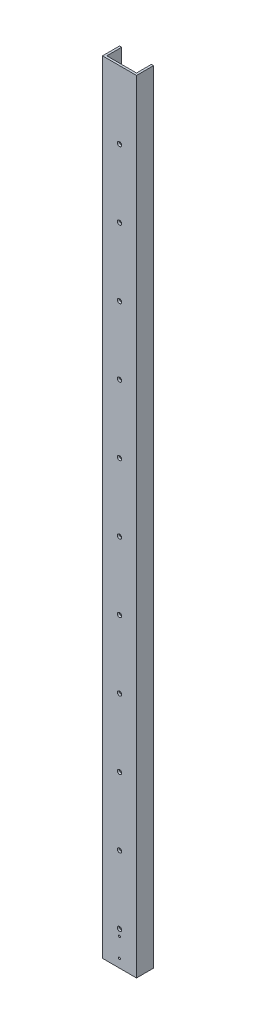
ISO-10303-21;
HEADER;
FILE_DESCRIPTION(('STEP AP214'),'2;1');
FILE_NAME('part.step','',(''),(''),'','','');
FILE_SCHEMA(('AUTOMOTIVE_DESIGN { 1 0 10303 214 1 1 1 1 }'));
ENDSEC;
DATA;
#1=APPLICATION_CONTEXT('core data for automotive mechanical design processes');
#2=APPLICATION_PROTOCOL_DEFINITION('international standard','automotive_design',2000,#1);
#3=PRODUCT_CONTEXT('',#1,'mechanical');
#4=PRODUCT('Part','Part','',(#3));
#5=PRODUCT_RELATED_PRODUCT_CATEGORY('part','',(#4));
#6=PRODUCT_DEFINITION_FORMATION('','',#4);
#7=PRODUCT_DEFINITION_CONTEXT('part definition',#1,'design');
#8=PRODUCT_DEFINITION('design','',#6,#7);
#9=PRODUCT_DEFINITION_SHAPE('','',#8);
#10=(LENGTH_UNIT() NAMED_UNIT(*) SI_UNIT(.MILLI.,.METRE.));
#11=(NAMED_UNIT(*) PLANE_ANGLE_UNIT() SI_UNIT($,.RADIAN.));
#12=(NAMED_UNIT(*) SI_UNIT($,.STERADIAN.) SOLID_ANGLE_UNIT());
#13=UNCERTAINTY_MEASURE_WITH_UNIT(LENGTH_MEASURE(1.E-05),#10,'distance_accuracy_value','');
#14=(GEOMETRIC_REPRESENTATION_CONTEXT(3) GLOBAL_UNCERTAINTY_ASSIGNED_CONTEXT((#13)) GLOBAL_UNIT_ASSIGNED_CONTEXT((#10,
#11,#12)) REPRESENTATION_CONTEXT('',''));
#15=CARTESIAN_POINT('',(0.,0.,0.));
#16=DIRECTION('',(0.,0.,1.));
#17=DIRECTION('',(1.,0.,0.));
#18=AXIS2_PLACEMENT_3D('',#15,#16,#17);
#19=CARTESIAN_POINT('',(0.,1168.4,0.));
#20=DIRECTION('',(1.,0.,0.));
#21=DIRECTION('',(0.,0.,-1.));
#22=AXIS2_PLACEMENT_3D('',#19,#20,#21);
#23=PLANE('',#22);
#24=DIRECTION('',(0.,0.,1.));
#25=VECTOR('',#24,1.);
#26=CARTESIAN_POINT('',(0.,0.,0.));
#27=LINE('',#26,#25);
#28=CARTESIAN_POINT('',(0.,0.,-25.4));
#29=VERTEX_POINT('',#28);
#30=CARTESIAN_POINT('',(0.,0.,0.));
#31=VERTEX_POINT('',#30);
#32=EDGE_CURVE('E134',#29,#31,#27,.T.);
#33=ORIENTED_EDGE('',*,*,#32,.T.);
#34=DIRECTION('',(0.,-1.,0.));
#35=VECTOR('',#34,1.);
#36=CARTESIAN_POINT('',(0.,1168.4,0.));
#37=LINE('',#36,#35);
#38=CARTESIAN_POINT('',(0.,1168.4,0.));
#39=VERTEX_POINT('',#38);
#40=EDGE_CURVE('E11',#39,#31,#37,.T.);
#41=ORIENTED_EDGE('',*,*,#40,.F.);
#42=DIRECTION('',(0.,0.,1.));
#43=VECTOR('',#42,1.);
#44=CARTESIAN_POINT('',(0.,1168.4,0.));
#45=LINE('',#44,#43);
#46=CARTESIAN_POINT('',(0.,1168.4,-25.4));
#47=VERTEX_POINT('',#46);
#48=EDGE_CURVE('E149',#47,#39,#45,.T.);
#49=ORIENTED_EDGE('',*,*,#48,.F.);
#50=DIRECTION('',(0.,-1.,0.));
#51=VECTOR('',#50,1.);
#52=CARTESIAN_POINT('',(0.,1168.4,-25.4));
#53=LINE('',#52,#51);
#54=EDGE_CURVE('E130',#47,#29,#53,.T.);
#55=ORIENTED_EDGE('',*,*,#54,.T.);
#56=EDGE_LOOP('',(#33,#41,#49,#55));
#57=FACE_BOUND('',#56,.T.);
#58=ADVANCED_FACE('F38',(#57),#23,.F.);
#59=CARTESIAN_POINT('',(0.,1168.4,0.));
#60=DIRECTION('',(0.,0.,-1.));
#61=DIRECTION('',(-1.,0.,0.));
#62=AXIS2_PLACEMENT_3D('',#59,#60,#61);
#63=PLANE('',#62);
#64=CARTESIAN_POINT('',(25.4,41.2749999999968,0.));
#65=DIRECTION('',(0.,0.,1.));
#66=DIRECTION('',(1.,0.,0.));
#67=AXIS2_PLACEMENT_3D('',#64,#65,#66);
#68=CIRCLE('',#67,1.5875);
#69=CARTESIAN_POINT('',(26.9875,41.2749999999968,0.));
#70=VERTEX_POINT('',#69);
#71=EDGE_CURVE('E251',#70,#70,#68,.T.);
#72=ORIENTED_EDGE('',*,*,#71,.F.);
#73=EDGE_LOOP('',(#72));
#74=FACE_BOUND('',#73,.T.);
#75=CARTESIAN_POINT('',(25.4,12.6999999999968,0.));
#76=DIRECTION('',(0.,0.,1.));
#77=DIRECTION('',(1.,0.,0.));
#78=AXIS2_PLACEMENT_3D('',#75,#76,#77);
#79=CIRCLE('',#78,1.5875);
#80=CARTESIAN_POINT('',(26.9875,12.6999999999968,0.));
#81=VERTEX_POINT('',#80);
#82=EDGE_CURVE('E252',#81,#81,#79,.T.);
#83=ORIENTED_EDGE('',*,*,#82,.F.);
#84=EDGE_LOOP('',(#83));
#85=FACE_BOUND('',#84,.T.);
#86=CARTESIAN_POINT('',(25.4,50.8,0.));
#87=DIRECTION('',(0.,0.,1.));
#88=DIRECTION('',(1.,0.,0.));
#89=AXIS2_PLACEMENT_3D('',#86,#87,#88);
#90=CIRCLE('',#89,3.175);
#91=CARTESIAN_POINT('',(28.575,50.8,0.));
#92=VERTEX_POINT('',#91);
#93=EDGE_CURVE('E241',#92,#92,#90,.T.);
#94=ORIENTED_EDGE('',*,*,#93,.F.);
#95=EDGE_LOOP('',(#94));
#96=FACE_BOUND('',#95,.T.);
#97=CARTESIAN_POINT('',(25.4,152.4,0.));
#98=DIRECTION('',(0.,0.,1.));
#99=DIRECTION('',(1.,0.,0.));
#100=AXIS2_PLACEMENT_3D('',#97,#98,#99);
#101=CIRCLE('',#100,3.175);
#102=CARTESIAN_POINT('',(28.575,152.4,0.));
#103=VERTEX_POINT('',#102);
#104=EDGE_CURVE('E235',#103,#103,#101,.T.);
#105=ORIENTED_EDGE('',*,*,#104,.F.);
#106=EDGE_LOOP('',(#105));
#107=FACE_BOUND('',#106,.T.);
#108=CARTESIAN_POINT('',(25.4,254.,0.));
#109=DIRECTION('',(0.,0.,1.));
#110=DIRECTION('',(1.,0.,0.));
#111=AXIS2_PLACEMENT_3D('',#108,#109,#110);
#112=CIRCLE('',#111,3.175);
#113=CARTESIAN_POINT('',(28.575,254.,0.));
#114=VERTEX_POINT('',#113);
#115=EDGE_CURVE('E229',#114,#114,#112,.T.);
#116=ORIENTED_EDGE('',*,*,#115,.F.);
#117=EDGE_LOOP('',(#116));
#118=FACE_BOUND('',#117,.T.);
#119=CARTESIAN_POINT('',(25.4,355.6,0.));
#120=DIRECTION('',(0.,0.,1.));
#121=DIRECTION('',(1.,0.,0.));
#122=AXIS2_PLACEMENT_3D('',#119,#120,#121);
#123=CIRCLE('',#122,3.17499999999997);
#124=CARTESIAN_POINT('',(28.575,355.6,0.));
#125=VERTEX_POINT('',#124);
#126=EDGE_CURVE('E223',#125,#125,#123,.T.);
#127=ORIENTED_EDGE('',*,*,#126,.F.);
#128=EDGE_LOOP('',(#127));
#129=FACE_BOUND('',#128,.T.);
#130=CARTESIAN_POINT('',(25.4,457.2,0.));
#131=DIRECTION('',(0.,0.,1.));
#132=DIRECTION('',(1.,0.,0.));
#133=AXIS2_PLACEMENT_3D('',#130,#131,#132);
#134=CIRCLE('',#133,3.17500000000002);
#135=CARTESIAN_POINT('',(28.575,457.2,0.));
#136=VERTEX_POINT('',#135);
#137=EDGE_CURVE('E217',#136,#136,#134,.T.);
#138=ORIENTED_EDGE('',*,*,#137,.F.);
#139=EDGE_LOOP('',(#138));
#140=FACE_BOUND('',#139,.T.);
#141=CARTESIAN_POINT('',(25.4,558.8,0.));
#142=DIRECTION('',(0.,0.,1.));
#143=DIRECTION('',(1.,0.,0.));
#144=AXIS2_PLACEMENT_3D('',#141,#142,#143);
#145=CIRCLE('',#144,3.175);
#146=CARTESIAN_POINT('',(28.575,558.8,0.));
#147=VERTEX_POINT('',#146);
#148=EDGE_CURVE('E211',#147,#147,#145,.T.);
#149=ORIENTED_EDGE('',*,*,#148,.F.);
#150=EDGE_LOOP('',(#149));
#151=FACE_BOUND('',#150,.T.);
#152=CARTESIAN_POINT('',(25.4,660.4,0.));
#153=DIRECTION('',(0.,0.,1.));
#154=DIRECTION('',(1.,0.,0.));
#155=AXIS2_PLACEMENT_3D('',#152,#153,#154);
#156=CIRCLE('',#155,3.175);
#157=CARTESIAN_POINT('',(28.575,660.4,0.));
#158=VERTEX_POINT('',#157);
#159=EDGE_CURVE('E205',#158,#158,#156,.T.);
#160=ORIENTED_EDGE('',*,*,#159,.F.);
#161=EDGE_LOOP('',(#160));
#162=FACE_BOUND('',#161,.T.);
#163=CARTESIAN_POINT('',(25.4,762.,0.));
#164=DIRECTION('',(0.,0.,1.));
#165=DIRECTION('',(1.,0.,0.));
#166=AXIS2_PLACEMENT_3D('',#163,#164,#165);
#167=CIRCLE('',#166,3.175);
#168=CARTESIAN_POINT('',(28.575,762.,0.));
#169=VERTEX_POINT('',#168);
#170=EDGE_CURVE('E199',#169,#169,#167,.T.);
#171=ORIENTED_EDGE('',*,*,#170,.F.);
#172=EDGE_LOOP('',(#171));
#173=FACE_BOUND('',#172,.T.);
#174=CARTESIAN_POINT('',(25.4,863.6,0.));
#175=DIRECTION('',(0.,0.,1.));
#176=DIRECTION('',(1.,0.,0.));
#177=AXIS2_PLACEMENT_3D('',#174,#175,#176);
#178=CIRCLE('',#177,3.175);
#179=CARTESIAN_POINT('',(28.575,863.6,0.));
#180=VERTEX_POINT('',#179);
#181=EDGE_CURVE('E193',#180,#180,#178,.T.);
#182=ORIENTED_EDGE('',*,*,#181,.F.);
#183=EDGE_LOOP('',(#182));
#184=FACE_BOUND('',#183,.T.);
#185=CARTESIAN_POINT('',(25.4,965.2,0.));
#186=DIRECTION('',(0.,0.,1.));
#187=DIRECTION('',(1.,0.,0.));
#188=AXIS2_PLACEMENT_3D('',#185,#186,#187);
#189=CIRCLE('',#188,3.175);
#190=CARTESIAN_POINT('',(28.575,965.2,0.));
#191=VERTEX_POINT('',#190);
#192=EDGE_CURVE('E185',#191,#191,#189,.T.);
#193=ORIENTED_EDGE('',*,*,#192,.F.);
#194=EDGE_LOOP('',(#193));
#195=FACE_BOUND('',#194,.T.);
#196=CARTESIAN_POINT('',(25.4,1066.8,0.));
#197=DIRECTION('',(0.,0.,1.));
#198=DIRECTION('',(1.,0.,0.));
#199=AXIS2_PLACEMENT_3D('',#196,#197,#198);
#200=CIRCLE('',#199,3.17499999999994);
#201=CARTESIAN_POINT('',(28.5749999999999,1066.8,0.));
#202=VERTEX_POINT('',#201);
#203=EDGE_CURVE('E186',#202,#202,#200,.T.);
#204=ORIENTED_EDGE('',*,*,#203,.F.);
#205=EDGE_LOOP('',(#204));
#206=FACE_BOUND('',#205,.T.);
#207=DIRECTION('',(1.,0.,0.));
#208=VECTOR('',#207,1.);
#209=CARTESIAN_POINT('',(0.,0.,0.));
#210=LINE('',#209,#208);
#211=CARTESIAN_POINT('',(50.8,0.,0.));
#212=VERTEX_POINT('',#211);
#213=EDGE_CURVE('E137',#31,#212,#210,.T.);
#214=ORIENTED_EDGE('',*,*,#213,.T.);
#215=DIRECTION('',(0.,-1.,0.));
#216=VECTOR('',#215,1.);
#217=CARTESIAN_POINT('',(50.8,1168.4,0.));
#218=LINE('',#217,#216);
#219=CARTESIAN_POINT('',(50.8,1168.4,0.));
#220=VERTEX_POINT('',#219);
#221=EDGE_CURVE('E46',#220,#212,#218,.T.);
#222=ORIENTED_EDGE('',*,*,#221,.F.);
#223=DIRECTION('',(1.,0.,0.));
#224=VECTOR('',#223,1.);
#225=CARTESIAN_POINT('',(0.,1168.4,0.));
#226=LINE('',#225,#224);
#227=EDGE_CURVE('E97',#39,#220,#226,.T.);
#228=ORIENTED_EDGE('',*,*,#227,.F.);
#229=ORIENTED_EDGE('',*,*,#40,.T.);
#230=EDGE_LOOP('',(#214,#222,#228,#229));
#231=FACE_BOUND('',#230,.T.);
#232=ADVANCED_FACE('F263',(#74,#85,#96,#107,#118,#129,#140,#151,#162,#173,#184,#195,#206,#231),
#63,.F.);
#233=CARTESIAN_POINT('',(50.8,1168.4,0.));
#234=DIRECTION('',(-1.,0.,0.));
#235=DIRECTION('',(0.,0.,1.));
#236=AXIS2_PLACEMENT_3D('',#233,#234,#235);
#237=PLANE('',#236);
#238=DIRECTION('',(0.,0.,-1.));
#239=VECTOR('',#238,1.);
#240=CARTESIAN_POINT('',(50.8,0.,0.));
#241=LINE('',#240,#239);
#242=CARTESIAN_POINT('',(50.8,0.,-25.4));
#243=VERTEX_POINT('',#242);
#244=EDGE_CURVE('E140',#212,#243,#241,.T.);
#245=ORIENTED_EDGE('',*,*,#244,.T.);
#246=DIRECTION('',(0.,-1.,0.));
#247=VECTOR('',#246,1.);
#248=CARTESIAN_POINT('',(50.8,1168.4,-25.4));
#249=LINE('',#248,#247);
#250=CARTESIAN_POINT('',(50.8,1168.4,-25.4));
#251=VERTEX_POINT('',#250);
#252=EDGE_CURVE('E156',#251,#243,#249,.T.);
#253=ORIENTED_EDGE('',*,*,#252,.F.);
#254=DIRECTION('',(0.,0.,-1.));
#255=VECTOR('',#254,1.);
#256=CARTESIAN_POINT('',(50.8,1168.4,0.));
#257=LINE('',#256,#255);
#258=EDGE_CURVE('E164',#220,#251,#257,.T.);
#259=ORIENTED_EDGE('',*,*,#258,.F.);
#260=ORIENTED_EDGE('',*,*,#221,.T.);
#261=EDGE_LOOP('',(#245,#253,#259,#260));
#262=FACE_BOUND('',#261,.T.);
#263=ADVANCED_FACE('F162',(#262),#237,.F.);
#264=CARTESIAN_POINT('',(50.8,1168.4,-25.4));
#265=DIRECTION('',(0.,0.,1.));
#266=DIRECTION('',(1.,0.,0.));
#267=AXIS2_PLACEMENT_3D('',#264,#265,#266);
#268=PLANE('',#267);
#269=DIRECTION('',(-1.,0.,0.));
#270=VECTOR('',#269,1.);
#271=CARTESIAN_POINT('',(50.8,0.,-25.4));
#272=LINE('',#271,#270);
#273=CARTESIAN_POINT('',(47.625,0.,-25.4));
#274=VERTEX_POINT('',#273);
#275=EDGE_CURVE('E142',#243,#274,#272,.T.);
#276=ORIENTED_EDGE('',*,*,#275,.T.);
#277=DIRECTION('',(0.,-1.,0.));
#278=VECTOR('',#277,1.);
#279=CARTESIAN_POINT('',(47.625,1168.4,-25.4));
#280=LINE('',#279,#278);
#281=CARTESIAN_POINT('',(47.625,1168.4,-25.4));
#282=VERTEX_POINT('',#281);
#283=EDGE_CURVE('E153',#282,#274,#280,.T.);
#284=ORIENTED_EDGE('',*,*,#283,.F.);
#285=DIRECTION('',(-1.,0.,0.));
#286=VECTOR('',#285,1.);
#287=CARTESIAN_POINT('',(50.8,1168.4,-25.4));
#288=LINE('',#287,#286);
#289=EDGE_CURVE('E176',#251,#282,#288,.T.);
#290=ORIENTED_EDGE('',*,*,#289,.F.);
#291=ORIENTED_EDGE('',*,*,#252,.T.);
#292=EDGE_LOOP('',(#276,#284,#290,#291));
#293=FACE_BOUND('',#292,.T.);
#294=ADVANCED_FACE('F172',(#293),#268,.F.);
#295=CARTESIAN_POINT('',(47.625,1168.4,-3.175));
#296=DIRECTION('',(1.,0.,0.));
#297=DIRECTION('',(0.,0.,-1.));
#298=AXIS2_PLACEMENT_3D('',#295,#296,#297);
#299=PLANE('',#298);
#300=DIRECTION('',(0.,0.,1.));
#301=VECTOR('',#300,1.);
#302=CARTESIAN_POINT('',(47.625,0.,-3.175));
#303=LINE('',#302,#301);
#304=CARTESIAN_POINT('',(47.625,0.,-3.175));
#305=VERTEX_POINT('',#304);
#306=EDGE_CURVE('E144',#274,#305,#303,.T.);
#307=ORIENTED_EDGE('',*,*,#306,.T.);
#308=DIRECTION('',(0.,-1.,0.));
#309=VECTOR('',#308,1.);
#310=CARTESIAN_POINT('',(47.625,1168.4,-3.175));
#311=LINE('',#310,#309);
#312=CARTESIAN_POINT('',(47.625,1168.4,-3.175));
#313=VERTEX_POINT('',#312);
#314=EDGE_CURVE('E125',#313,#305,#311,.T.);
#315=ORIENTED_EDGE('',*,*,#314,.F.);
#316=DIRECTION('',(0.,0.,1.));
#317=VECTOR('',#316,1.);
#318=CARTESIAN_POINT('',(47.625,1168.4,-3.175));
#319=LINE('',#318,#317);
#320=EDGE_CURVE('E116',#282,#313,#319,.T.);
#321=ORIENTED_EDGE('',*,*,#320,.F.);
#322=ORIENTED_EDGE('',*,*,#283,.T.);
#323=EDGE_LOOP('',(#307,#315,#321,#322));
#324=FACE_BOUND('',#323,.T.);
#325=ADVANCED_FACE('F175',(#324),#299,.F.);
#326=CARTESIAN_POINT('',(3.175,1168.4,-3.175));
#327=DIRECTION('',(0.,0.,1.));
#328=DIRECTION('',(1.,0.,0.));
#329=AXIS2_PLACEMENT_3D('',#326,#327,#328);
#330=PLANE('',#329);
#331=CARTESIAN_POINT('',(25.4,41.2749999999968,-3.175));
#332=DIRECTION('',(0.,0.,1.));
#333=DIRECTION('',(1.,0.,0.));
#334=AXIS2_PLACEMENT_3D('',#331,#332,#333);
#335=CIRCLE('',#334,1.5875);
#336=CARTESIAN_POINT('',(26.9875,41.2749999999968,-3.175));
#337=VERTEX_POINT('',#336);
#338=EDGE_CURVE('E189',#337,#337,#335,.F.);
#339=ORIENTED_EDGE('',*,*,#338,.F.);
#340=EDGE_LOOP('',(#339));
#341=FACE_BOUND('',#340,.T.);
#342=CARTESIAN_POINT('',(25.4,12.6999999999968,-3.175));
#343=DIRECTION('',(0.,0.,1.));
#344=DIRECTION('',(1.,0.,0.));
#345=AXIS2_PLACEMENT_3D('',#342,#343,#344);
#346=CIRCLE('',#345,1.5875);
#347=CARTESIAN_POINT('',(26.9875,12.6999999999968,-3.175));
#348=VERTEX_POINT('',#347);
#349=EDGE_CURVE('E248',#348,#348,#346,.F.);
#350=ORIENTED_EDGE('',*,*,#349,.F.);
#351=EDGE_LOOP('',(#350));
#352=FACE_BOUND('',#351,.T.);
#353=CARTESIAN_POINT('',(25.4,50.8,-3.175));
#354=DIRECTION('',(0.,0.,1.));
#355=DIRECTION('',(1.,0.,0.));
#356=AXIS2_PLACEMENT_3D('',#353,#354,#355);
#357=CIRCLE('',#356,3.175);
#358=CARTESIAN_POINT('',(28.575,50.8,-3.175));
#359=VERTEX_POINT('',#358);
#360=EDGE_CURVE('E138',#359,#359,#357,.F.);
#361=ORIENTED_EDGE('',*,*,#360,.F.);
#362=EDGE_LOOP('',(#361));
#363=FACE_BOUND('',#362,.T.);
#364=CARTESIAN_POINT('',(25.4,152.4,-3.175));
#365=DIRECTION('',(0.,0.,1.));
#366=DIRECTION('',(1.,0.,0.));
#367=AXIS2_PLACEMENT_3D('',#364,#365,#366);
#368=CIRCLE('',#367,3.175);
#369=CARTESIAN_POINT('',(28.575,152.4,-3.175));
#370=VERTEX_POINT('',#369);
#371=EDGE_CURVE('E238',#370,#370,#368,.F.);
#372=ORIENTED_EDGE('',*,*,#371,.F.);
#373=EDGE_LOOP('',(#372));
#374=FACE_BOUND('',#373,.T.);
#375=CARTESIAN_POINT('',(25.4,254.,-3.175));
#376=DIRECTION('',(0.,0.,1.));
#377=DIRECTION('',(1.,0.,0.));
#378=AXIS2_PLACEMENT_3D('',#375,#376,#377);
#379=CIRCLE('',#378,3.175);
#380=CARTESIAN_POINT('',(28.575,254.,-3.175));
#381=VERTEX_POINT('',#380);
#382=EDGE_CURVE('E232',#381,#381,#379,.F.);
#383=ORIENTED_EDGE('',*,*,#382,.F.);
#384=EDGE_LOOP('',(#383));
#385=FACE_BOUND('',#384,.T.);
#386=CARTESIAN_POINT('',(25.4,355.6,-3.175));
#387=DIRECTION('',(0.,0.,1.));
#388=DIRECTION('',(1.,0.,0.));
#389=AXIS2_PLACEMENT_3D('',#386,#387,#388);
#390=CIRCLE('',#389,3.17499999999997);
#391=CARTESIAN_POINT('',(28.575,355.6,-3.175));
#392=VERTEX_POINT('',#391);
#393=EDGE_CURVE('E226',#392,#392,#390,.F.);
#394=ORIENTED_EDGE('',*,*,#393,.F.);
#395=EDGE_LOOP('',(#394));
#396=FACE_BOUND('',#395,.T.);
#397=CARTESIAN_POINT('',(25.4,457.2,-3.175));
#398=DIRECTION('',(0.,0.,1.));
#399=DIRECTION('',(1.,0.,0.));
#400=AXIS2_PLACEMENT_3D('',#397,#398,#399);
#401=CIRCLE('',#400,3.17500000000002);
#402=CARTESIAN_POINT('',(28.575,457.2,-3.175));
#403=VERTEX_POINT('',#402);
#404=EDGE_CURVE('E220',#403,#403,#401,.F.);
#405=ORIENTED_EDGE('',*,*,#404,.F.);
#406=EDGE_LOOP('',(#405));
#407=FACE_BOUND('',#406,.T.);
#408=CARTESIAN_POINT('',(25.4,558.8,-3.175));
#409=DIRECTION('',(0.,0.,1.));
#410=DIRECTION('',(1.,0.,0.));
#411=AXIS2_PLACEMENT_3D('',#408,#409,#410);
#412=CIRCLE('',#411,3.175);
#413=CARTESIAN_POINT('',(28.575,558.8,-3.175));
#414=VERTEX_POINT('',#413);
#415=EDGE_CURVE('E214',#414,#414,#412,.F.);
#416=ORIENTED_EDGE('',*,*,#415,.F.);
#417=EDGE_LOOP('',(#416));
#418=FACE_BOUND('',#417,.T.);
#419=CARTESIAN_POINT('',(25.4,660.4,-3.175));
#420=DIRECTION('',(0.,0.,1.));
#421=DIRECTION('',(1.,0.,0.));
#422=AXIS2_PLACEMENT_3D('',#419,#420,#421);
#423=CIRCLE('',#422,3.175);
#424=CARTESIAN_POINT('',(28.575,660.4,-3.175));
#425=VERTEX_POINT('',#424);
#426=EDGE_CURVE('E208',#425,#425,#423,.F.);
#427=ORIENTED_EDGE('',*,*,#426,.F.);
#428=EDGE_LOOP('',(#427));
#429=FACE_BOUND('',#428,.T.);
#430=CARTESIAN_POINT('',(25.4,762.,-3.175));
#431=DIRECTION('',(0.,0.,1.));
#432=DIRECTION('',(1.,0.,0.));
#433=AXIS2_PLACEMENT_3D('',#430,#431,#432);
#434=CIRCLE('',#433,3.175);
#435=CARTESIAN_POINT('',(28.575,762.,-3.175));
#436=VERTEX_POINT('',#435);
#437=EDGE_CURVE('E202',#436,#436,#434,.F.);
#438=ORIENTED_EDGE('',*,*,#437,.F.);
#439=EDGE_LOOP('',(#438));
#440=FACE_BOUND('',#439,.T.);
#441=CARTESIAN_POINT('',(25.4,863.6,-3.175));
#442=DIRECTION('',(0.,0.,1.));
#443=DIRECTION('',(1.,0.,0.));
#444=AXIS2_PLACEMENT_3D('',#441,#442,#443);
#445=CIRCLE('',#444,3.175);
#446=CARTESIAN_POINT('',(28.575,863.6,-3.175));
#447=VERTEX_POINT('',#446);
#448=EDGE_CURVE('E196',#447,#447,#445,.F.);
#449=ORIENTED_EDGE('',*,*,#448,.F.);
#450=EDGE_LOOP('',(#449));
#451=FACE_BOUND('',#450,.T.);
#452=CARTESIAN_POINT('',(25.4,965.2,-3.175));
#453=DIRECTION('',(0.,0.,1.));
#454=DIRECTION('',(1.,0.,0.));
#455=AXIS2_PLACEMENT_3D('',#452,#453,#454);
#456=CIRCLE('',#455,3.175);
#457=CARTESIAN_POINT('',(28.575,965.2,-3.175));
#458=VERTEX_POINT('',#457);
#459=EDGE_CURVE('E190',#458,#458,#456,.F.);
#460=ORIENTED_EDGE('',*,*,#459,.F.);
#461=EDGE_LOOP('',(#460));
#462=FACE_BOUND('',#461,.T.);
#463=CARTESIAN_POINT('',(25.4,1066.8,-3.175));
#464=DIRECTION('',(0.,0.,1.));
#465=DIRECTION('',(1.,0.,0.));
#466=AXIS2_PLACEMENT_3D('',#463,#464,#465);
#467=CIRCLE('',#466,3.17499999999994);
#468=CARTESIAN_POINT('',(28.5749999999999,1066.8,-3.175));
#469=VERTEX_POINT('',#468);
#470=EDGE_CURVE('E182',#469,#469,#467,.F.);
#471=ORIENTED_EDGE('',*,*,#470,.F.);
#472=EDGE_LOOP('',(#471));
#473=FACE_BOUND('',#472,.T.);
#474=DIRECTION('',(-1.,0.,0.));
#475=VECTOR('',#474,1.);
#476=CARTESIAN_POINT('',(3.175,0.,-3.175));
#477=LINE('',#476,#475);
#478=CARTESIAN_POINT('',(3.175,0.,-3.175));
#479=VERTEX_POINT('',#478);
#480=EDGE_CURVE('E124',#305,#479,#477,.T.);
#481=ORIENTED_EDGE('',*,*,#480,.T.);
#482=DIRECTION('',(0.,-1.,0.));
#483=VECTOR('',#482,1.);
#484=CARTESIAN_POINT('',(3.175,1168.4,-3.175));
#485=LINE('',#484,#483);
#486=CARTESIAN_POINT('',(3.175,1168.4,-3.175));
#487=VERTEX_POINT('',#486);
#488=EDGE_CURVE('E121',#487,#479,#485,.T.);
#489=ORIENTED_EDGE('',*,*,#488,.F.);
#490=DIRECTION('',(-1.,0.,0.));
#491=VECTOR('',#490,1.);
#492=CARTESIAN_POINT('',(3.175,1168.4,-3.175));
#493=LINE('',#492,#491);
#494=EDGE_CURVE('E110',#313,#487,#493,.T.);
#495=ORIENTED_EDGE('',*,*,#494,.F.);
#496=ORIENTED_EDGE('',*,*,#314,.T.);
#497=EDGE_LOOP('',(#481,#489,#495,#496));
#498=FACE_BOUND('',#497,.T.);
#499=ADVANCED_FACE('F122',(#341,#352,#363,#374,#385,#396,#407,#418,#429,#440,#451,#462,#473,
#498),#330,.F.);
#500=CARTESIAN_POINT('',(3.175,1168.4,-3.175));
#501=DIRECTION('',(-1.,0.,0.));
#502=DIRECTION('',(0.,0.,1.));
#503=AXIS2_PLACEMENT_3D('',#500,#501,#502);
#504=PLANE('',#503);
#505=DIRECTION('',(0.,0.,-1.));
#506=VECTOR('',#505,1.);
#507=CARTESIAN_POINT('',(3.175,0.,-3.175));
#508=LINE('',#507,#506);
#509=CARTESIAN_POINT('',(3.175,0.,-25.4));
#510=VERTEX_POINT('',#509);
#511=EDGE_CURVE('E83',#479,#510,#508,.T.);
#512=ORIENTED_EDGE('',*,*,#511,.T.);
#513=DIRECTION('',(0.,-1.,0.));
#514=VECTOR('',#513,1.);
#515=CARTESIAN_POINT('',(3.175,1168.4,-25.4));
#516=LINE('',#515,#514);
#517=CARTESIAN_POINT('',(3.175,1168.4,-25.4));
#518=VERTEX_POINT('',#517);
#519=EDGE_CURVE('E126',#518,#510,#516,.T.);
#520=ORIENTED_EDGE('',*,*,#519,.F.);
#521=DIRECTION('',(0.,0.,-1.));
#522=VECTOR('',#521,1.);
#523=CARTESIAN_POINT('',(3.175,1168.4,-3.175));
#524=LINE('',#523,#522);
#525=EDGE_CURVE('E114',#487,#518,#524,.T.);
#526=ORIENTED_EDGE('',*,*,#525,.F.);
#527=ORIENTED_EDGE('',*,*,#488,.T.);
#528=EDGE_LOOP('',(#512,#520,#526,#527));
#529=FACE_BOUND('',#528,.T.);
#530=ADVANCED_FACE('F128',(#529),#504,.F.);
#531=CARTESIAN_POINT('',(0.,1168.4,-25.4));
#532=DIRECTION('',(0.,0.,1.));
#533=DIRECTION('',(1.,0.,0.));
#534=AXIS2_PLACEMENT_3D('',#531,#532,#533);
#535=PLANE('',#534);
#536=DIRECTION('',(-1.,0.,0.));
#537=VECTOR('',#536,1.);
#538=CARTESIAN_POINT('',(0.,0.,-25.4));
#539=LINE('',#538,#537);
#540=EDGE_CURVE('E89',#510,#29,#539,.T.);
#541=ORIENTED_EDGE('',*,*,#540,.T.);
#542=ORIENTED_EDGE('',*,*,#54,.F.);
#543=DIRECTION('',(-1.,0.,0.));
#544=VECTOR('',#543,1.);
#545=CARTESIAN_POINT('',(0.,1168.4,-25.4));
#546=LINE('',#545,#544);
#547=EDGE_CURVE('E54',#518,#47,#546,.T.);
#548=ORIENTED_EDGE('',*,*,#547,.F.);
#549=ORIENTED_EDGE('',*,*,#519,.T.);
#550=EDGE_LOOP('',(#541,#542,#548,#549));
#551=FACE_BOUND('',#550,.T.);
#552=ADVANCED_FACE('F292',(#551),#535,.F.);
#553=CARTESIAN_POINT('',(0.,1168.4,0.));
#554=DIRECTION('',(0.,-1.,0.));
#555=DIRECTION('',(0.,0.,-1.));
#556=AXIS2_PLACEMENT_3D('',#553,#554,#555);
#557=PLANE('',#556);
#558=ORIENTED_EDGE('',*,*,#48,.T.);
#559=ORIENTED_EDGE('',*,*,#227,.T.);
#560=ORIENTED_EDGE('',*,*,#258,.T.);
#561=ORIENTED_EDGE('',*,*,#289,.T.);
#562=ORIENTED_EDGE('',*,*,#320,.T.);
#563=ORIENTED_EDGE('',*,*,#494,.T.);
#564=ORIENTED_EDGE('',*,*,#525,.T.);
#565=ORIENTED_EDGE('',*,*,#547,.T.);
#566=EDGE_LOOP('',(#558,#559,#560,#561,#562,#563,#564,#565));
#567=FACE_BOUND('',#566,.T.);
#568=ADVANCED_FACE('F112',(#567),#557,.F.);
#569=CARTESIAN_POINT('',(0.,0.,0.));
#570=DIRECTION('',(0.,-1.,0.));
#571=DIRECTION('',(0.,0.,-1.));
#572=AXIS2_PLACEMENT_3D('',#569,#570,#571);
#573=PLANE('',#572);
#574=ORIENTED_EDGE('',*,*,#32,.F.);
#575=ORIENTED_EDGE('',*,*,#540,.F.);
#576=ORIENTED_EDGE('',*,*,#511,.F.);
#577=ORIENTED_EDGE('',*,*,#480,.F.);
#578=ORIENTED_EDGE('',*,*,#306,.F.);
#579=ORIENTED_EDGE('',*,*,#275,.F.);
#580=ORIENTED_EDGE('',*,*,#244,.F.);
#581=ORIENTED_EDGE('',*,*,#213,.F.);
#582=EDGE_LOOP('',(#574,#575,#576,#577,#578,#579,#580,#581));
#583=FACE_BOUND('',#582,.T.);
#584=ADVANCED_FACE('F168',(#583),#573,.T.);
#585=CARTESIAN_POINT('',(25.4,1066.8,-25.401));
#586=DIRECTION('',(0.,0.,1.));
#587=DIRECTION('',(1.,0.,0.));
#588=AXIS2_PLACEMENT_3D('',#585,#586,#587);
#589=CYLINDRICAL_SURFACE('',#588,3.17499999999994);
#590=ORIENTED_EDGE('',*,*,#203,.T.);
#591=EDGE_LOOP('',(#590));
#592=FACE_BOUND('',#591,.T.);
#593=ORIENTED_EDGE('',*,*,#470,.T.);
#594=EDGE_LOOP('',(#593));
#595=FACE_BOUND('',#594,.T.);
#596=ADVANCED_FACE('F359',(#592,#595),#589,.F.);
#597=CARTESIAN_POINT('',(25.4,965.2,-25.401));
#598=DIRECTION('',(0.,0.,1.));
#599=DIRECTION('',(1.,0.,0.));
#600=AXIS2_PLACEMENT_3D('',#597,#598,#599);
#601=CYLINDRICAL_SURFACE('',#600,3.175);
#602=ORIENTED_EDGE('',*,*,#192,.T.);
#603=EDGE_LOOP('',(#602));
#604=FACE_BOUND('',#603,.T.);
#605=ORIENTED_EDGE('',*,*,#459,.T.);
#606=EDGE_LOOP('',(#605));
#607=FACE_BOUND('',#606,.T.);
#608=ADVANCED_FACE('F367',(#604,#607),#601,.F.);
#609=CARTESIAN_POINT('',(25.4,863.6,-25.401));
#610=DIRECTION('',(0.,0.,1.));
#611=DIRECTION('',(1.,0.,0.));
#612=AXIS2_PLACEMENT_3D('',#609,#610,#611);
#613=CYLINDRICAL_SURFACE('',#612,3.175);
#614=ORIENTED_EDGE('',*,*,#181,.T.);
#615=EDGE_LOOP('',(#614));
#616=FACE_BOUND('',#615,.T.);
#617=ORIENTED_EDGE('',*,*,#448,.T.);
#618=EDGE_LOOP('',(#617));
#619=FACE_BOUND('',#618,.T.);
#620=ADVANCED_FACE('F377',(#616,#619),#613,.F.);
#621=CARTESIAN_POINT('',(25.4,762.,-25.401));
#622=DIRECTION('',(0.,0.,1.));
#623=DIRECTION('',(1.,0.,0.));
#624=AXIS2_PLACEMENT_3D('',#621,#622,#623);
#625=CYLINDRICAL_SURFACE('',#624,3.175);
#626=ORIENTED_EDGE('',*,*,#170,.T.);
#627=EDGE_LOOP('',(#626));
#628=FACE_BOUND('',#627,.T.);
#629=ORIENTED_EDGE('',*,*,#437,.T.);
#630=EDGE_LOOP('',(#629));
#631=FACE_BOUND('',#630,.T.);
#632=ADVANCED_FACE('F387',(#628,#631),#625,.F.);
#633=CARTESIAN_POINT('',(25.4,660.4,-25.401));
#634=DIRECTION('',(0.,0.,1.));
#635=DIRECTION('',(1.,0.,0.));
#636=AXIS2_PLACEMENT_3D('',#633,#634,#635);
#637=CYLINDRICAL_SURFACE('',#636,3.175);
#638=ORIENTED_EDGE('',*,*,#159,.T.);
#639=EDGE_LOOP('',(#638));
#640=FACE_BOUND('',#639,.T.);
#641=ORIENTED_EDGE('',*,*,#426,.T.);
#642=EDGE_LOOP('',(#641));
#643=FACE_BOUND('',#642,.T.);
#644=ADVANCED_FACE('F397',(#640,#643),#637,.F.);
#645=CARTESIAN_POINT('',(25.4,558.8,-25.401));
#646=DIRECTION('',(0.,0.,1.));
#647=DIRECTION('',(1.,0.,0.));
#648=AXIS2_PLACEMENT_3D('',#645,#646,#647);
#649=CYLINDRICAL_SURFACE('',#648,3.175);
#650=ORIENTED_EDGE('',*,*,#148,.T.);
#651=EDGE_LOOP('',(#650));
#652=FACE_BOUND('',#651,.T.);
#653=ORIENTED_EDGE('',*,*,#415,.T.);
#654=EDGE_LOOP('',(#653));
#655=FACE_BOUND('',#654,.T.);
#656=ADVANCED_FACE('F407',(#652,#655),#649,.F.);
#657=CARTESIAN_POINT('',(25.4,457.2,-25.401));
#658=DIRECTION('',(0.,0.,1.));
#659=DIRECTION('',(1.,0.,0.));
#660=AXIS2_PLACEMENT_3D('',#657,#658,#659);
#661=CYLINDRICAL_SURFACE('',#660,3.17500000000002);
#662=ORIENTED_EDGE('',*,*,#137,.T.);
#663=EDGE_LOOP('',(#662));
#664=FACE_BOUND('',#663,.T.);
#665=ORIENTED_EDGE('',*,*,#404,.T.);
#666=EDGE_LOOP('',(#665));
#667=FACE_BOUND('',#666,.T.);
#668=ADVANCED_FACE('F417',(#664,#667),#661,.F.);
#669=CARTESIAN_POINT('',(25.4,355.6,-25.401));
#670=DIRECTION('',(0.,0.,1.));
#671=DIRECTION('',(1.,0.,0.));
#672=AXIS2_PLACEMENT_3D('',#669,#670,#671);
#673=CYLINDRICAL_SURFACE('',#672,3.17499999999997);
#674=ORIENTED_EDGE('',*,*,#126,.T.);
#675=EDGE_LOOP('',(#674));
#676=FACE_BOUND('',#675,.T.);
#677=ORIENTED_EDGE('',*,*,#393,.T.);
#678=EDGE_LOOP('',(#677));
#679=FACE_BOUND('',#678,.T.);
#680=ADVANCED_FACE('F427',(#676,#679),#673,.F.);
#681=CARTESIAN_POINT('',(25.4,254.,-25.401));
#682=DIRECTION('',(0.,0.,1.));
#683=DIRECTION('',(1.,0.,0.));
#684=AXIS2_PLACEMENT_3D('',#681,#682,#683);
#685=CYLINDRICAL_SURFACE('',#684,3.175);
#686=ORIENTED_EDGE('',*,*,#115,.T.);
#687=EDGE_LOOP('',(#686));
#688=FACE_BOUND('',#687,.T.);
#689=ORIENTED_EDGE('',*,*,#382,.T.);
#690=EDGE_LOOP('',(#689));
#691=FACE_BOUND('',#690,.T.);
#692=ADVANCED_FACE('F437',(#688,#691),#685,.F.);
#693=CARTESIAN_POINT('',(25.4,152.4,-25.401));
#694=DIRECTION('',(0.,0.,1.));
#695=DIRECTION('',(1.,0.,0.));
#696=AXIS2_PLACEMENT_3D('',#693,#694,#695);
#697=CYLINDRICAL_SURFACE('',#696,3.175);
#698=ORIENTED_EDGE('',*,*,#104,.T.);
#699=EDGE_LOOP('',(#698));
#700=FACE_BOUND('',#699,.T.);
#701=ORIENTED_EDGE('',*,*,#371,.T.);
#702=EDGE_LOOP('',(#701));
#703=FACE_BOUND('',#702,.T.);
#704=ADVANCED_FACE('F447',(#700,#703),#697,.F.);
#705=CARTESIAN_POINT('',(25.4,50.8,-25.401));
#706=DIRECTION('',(0.,0.,1.));
#707=DIRECTION('',(1.,0.,0.));
#708=AXIS2_PLACEMENT_3D('',#705,#706,#707);
#709=CYLINDRICAL_SURFACE('',#708,3.175);
#710=ORIENTED_EDGE('',*,*,#93,.T.);
#711=EDGE_LOOP('',(#710));
#712=FACE_BOUND('',#711,.T.);
#713=ORIENTED_EDGE('',*,*,#360,.T.);
#714=EDGE_LOOP('',(#713));
#715=FACE_BOUND('',#714,.T.);
#716=ADVANCED_FACE('F456',(#712,#715),#709,.F.);
#717=CARTESIAN_POINT('',(25.4,12.6999999999968,-25.401));
#718=DIRECTION('',(0.,0.,1.));
#719=DIRECTION('',(1.,0.,0.));
#720=AXIS2_PLACEMENT_3D('',#717,#718,#719);
#721=CYLINDRICAL_SURFACE('',#720,1.5875);
#722=ORIENTED_EDGE('',*,*,#82,.T.);
#723=EDGE_LOOP('',(#722));
#724=FACE_BOUND('',#723,.T.);
#725=ORIENTED_EDGE('',*,*,#349,.T.);
#726=EDGE_LOOP('',(#725));
#727=FACE_BOUND('',#726,.T.);
#728=ADVANCED_FACE('F465',(#724,#727),#721,.F.);
#729=CARTESIAN_POINT('',(25.4,41.2749999999968,-25.401));
#730=DIRECTION('',(0.,0.,1.));
#731=DIRECTION('',(1.,0.,0.));
#732=AXIS2_PLACEMENT_3D('',#729,#730,#731);
#733=CYLINDRICAL_SURFACE('',#732,1.5875);
#734=ORIENTED_EDGE('',*,*,#71,.T.);
#735=EDGE_LOOP('',(#734));
#736=FACE_BOUND('',#735,.T.);
#737=ORIENTED_EDGE('',*,*,#338,.T.);
#738=EDGE_LOOP('',(#737));
#739=FACE_BOUND('',#738,.T.);
#740=ADVANCED_FACE('F260',(#736,#739),#733,.F.);
#741=CLOSED_SHELL('',(#58,#232,#263,#294,#325,#499,#530,#552,#568,#584,#596,#608,#620,#632,#644,
#656,#668,#680,#692,#704,#716,#728,#740));
#742=MANIFOLD_SOLID_BREP('B2',#741);
#743=ADVANCED_BREP_SHAPE_REPRESENTATION('',(#18,#742),#14);
#744=SHAPE_DEFINITION_REPRESENTATION(#9,#743);
ENDSEC;
END-ISO-10303-21;
